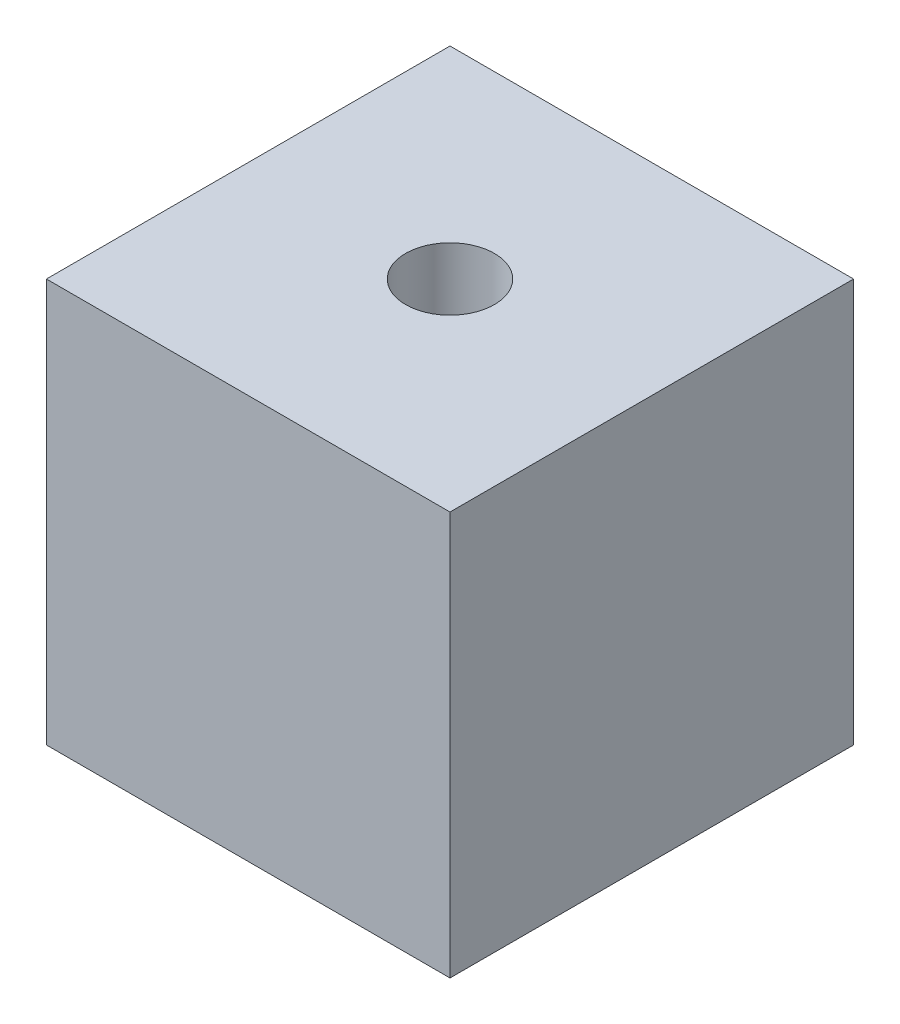
ISO-10303-21;
HEADER;
FILE_DESCRIPTION(('STEP AP214'),'2;1');
FILE_NAME('part.step','',(''),(''),'','','');
FILE_SCHEMA(('AUTOMOTIVE_DESIGN { 1 0 10303 214 1 1 1 1 }'));
ENDSEC;
DATA;
#1=APPLICATION_CONTEXT('core data for automotive mechanical design processes');
#2=APPLICATION_PROTOCOL_DEFINITION('international standard','automotive_design',2000,#1);
#3=PRODUCT_CONTEXT('',#1,'mechanical');
#4=PRODUCT('Part','Part','',(#3));
#5=PRODUCT_RELATED_PRODUCT_CATEGORY('part','',(#4));
#6=PRODUCT_DEFINITION_FORMATION('','',#4);
#7=PRODUCT_DEFINITION_CONTEXT('part definition',#1,'design');
#8=PRODUCT_DEFINITION('design','',#6,#7);
#9=PRODUCT_DEFINITION_SHAPE('','',#8);
#10=(LENGTH_UNIT() NAMED_UNIT(*) SI_UNIT(.MILLI.,.METRE.));
#11=(NAMED_UNIT(*) PLANE_ANGLE_UNIT() SI_UNIT($,.RADIAN.));
#12=(NAMED_UNIT(*) SI_UNIT($,.STERADIAN.) SOLID_ANGLE_UNIT());
#13=UNCERTAINTY_MEASURE_WITH_UNIT(LENGTH_MEASURE(1.E-05),#10,'distance_accuracy_value','');
#14=(GEOMETRIC_REPRESENTATION_CONTEXT(3) GLOBAL_UNCERTAINTY_ASSIGNED_CONTEXT((#13)) GLOBAL_UNIT_ASSIGNED_CONTEXT((#10,
#11,#12)) REPRESENTATION_CONTEXT('',''));
#15=CARTESIAN_POINT('',(0.,0.,0.));
#16=DIRECTION('',(0.,0.,1.));
#17=DIRECTION('',(1.,0.,0.));
#18=AXIS2_PLACEMENT_3D('',#15,#16,#17);
#19=CARTESIAN_POINT('',(0.,10.,0.));
#20=DIRECTION('',(1.,0.,0.));
#21=DIRECTION('',(0.,0.,-1.));
#22=AXIS2_PLACEMENT_3D('',#19,#20,#21);
#23=PLANE('',#22);
#24=DIRECTION('',(0.,0.,1.));
#25=VECTOR('',#24,1.);
#26=CARTESIAN_POINT('',(0.,0.,0.));
#27=LINE('',#26,#25);
#28=CARTESIAN_POINT('',(0.,0.,-10.));
#29=VERTEX_POINT('',#28);
#30=CARTESIAN_POINT('',(0.,0.,0.));
#31=VERTEX_POINT('',#30);
#32=EDGE_CURVE('E102',#29,#31,#27,.T.);
#33=ORIENTED_EDGE('',*,*,#32,.T.);
#34=DIRECTION('',(0.,-1.,0.));
#35=VECTOR('',#34,1.);
#36=CARTESIAN_POINT('',(0.,10.,0.));
#37=LINE('',#36,#35);
#38=CARTESIAN_POINT('',(0.,10.,0.));
#39=VERTEX_POINT('',#38);
#40=EDGE_CURVE('E11',#39,#31,#37,.T.);
#41=ORIENTED_EDGE('',*,*,#40,.F.);
#42=DIRECTION('',(0.,0.,1.));
#43=VECTOR('',#42,1.);
#44=CARTESIAN_POINT('',(0.,10.,0.));
#45=LINE('',#44,#43);
#46=CARTESIAN_POINT('',(0.,10.,-10.));
#47=VERTEX_POINT('',#46);
#48=EDGE_CURVE('E113',#47,#39,#45,.T.);
#49=ORIENTED_EDGE('',*,*,#48,.F.);
#50=DIRECTION('',(0.,-1.,0.));
#51=VECTOR('',#50,1.);
#52=CARTESIAN_POINT('',(0.,10.,-10.));
#53=LINE('',#52,#51);
#54=EDGE_CURVE('E122',#47,#29,#53,.T.);
#55=ORIENTED_EDGE('',*,*,#54,.T.);
#56=EDGE_LOOP('',(#33,#41,#49,#55));
#57=FACE_BOUND('',#56,.T.);
#58=ADVANCED_FACE('F39',(#57),#23,.F.);
#59=CARTESIAN_POINT('',(0.,10.,0.));
#60=DIRECTION('',(0.,0.,-1.));
#61=DIRECTION('',(-1.,0.,0.));
#62=AXIS2_PLACEMENT_3D('',#59,#60,#61);
#63=PLANE('',#62);
#64=DIRECTION('',(1.,0.,0.));
#65=VECTOR('',#64,1.);
#66=CARTESIAN_POINT('',(0.,0.,0.));
#67=LINE('',#66,#65);
#68=CARTESIAN_POINT('',(10.,0.,0.));
#69=VERTEX_POINT('',#68);
#70=EDGE_CURVE('E108',#31,#69,#67,.T.);
#71=ORIENTED_EDGE('',*,*,#70,.T.);
#72=DIRECTION('',(0.,-1.,0.));
#73=VECTOR('',#72,1.);
#74=CARTESIAN_POINT('',(10.,10.,0.));
#75=LINE('',#74,#73);
#76=CARTESIAN_POINT('',(10.,10.,0.));
#77=VERTEX_POINT('',#76);
#78=EDGE_CURVE('E48',#77,#69,#75,.T.);
#79=ORIENTED_EDGE('',*,*,#78,.F.);
#80=DIRECTION('',(1.,0.,0.));
#81=VECTOR('',#80,1.);
#82=CARTESIAN_POINT('',(0.,10.,0.));
#83=LINE('',#82,#81);
#84=EDGE_CURVE('E87',#39,#77,#83,.T.);
#85=ORIENTED_EDGE('',*,*,#84,.F.);
#86=ORIENTED_EDGE('',*,*,#40,.T.);
#87=EDGE_LOOP('',(#71,#79,#85,#86));
#88=FACE_BOUND('',#87,.T.);
#89=ADVANCED_FACE('F152',(#88),#63,.F.);
#90=CARTESIAN_POINT('',(10.,10.,0.));
#91=DIRECTION('',(-1.,0.,0.));
#92=DIRECTION('',(0.,0.,1.));
#93=AXIS2_PLACEMENT_3D('',#90,#91,#92);
#94=PLANE('',#93);
#95=DIRECTION('',(0.,0.,-1.));
#96=VECTOR('',#95,1.);
#97=CARTESIAN_POINT('',(10.,0.,0.));
#98=LINE('',#97,#96);
#99=CARTESIAN_POINT('',(10.,0.,-10.));
#100=VERTEX_POINT('',#99);
#101=EDGE_CURVE('E74',#69,#100,#98,.T.);
#102=ORIENTED_EDGE('',*,*,#101,.T.);
#103=DIRECTION('',(0.,-1.,0.));
#104=VECTOR('',#103,1.);
#105=CARTESIAN_POINT('',(10.,10.,-10.));
#106=LINE('',#105,#104);
#107=CARTESIAN_POINT('',(10.,10.,-10.));
#108=VERTEX_POINT('',#107);
#109=EDGE_CURVE('E132',#108,#100,#106,.T.);
#110=ORIENTED_EDGE('',*,*,#109,.F.);
#111=DIRECTION('',(0.,0.,-1.));
#112=VECTOR('',#111,1.);
#113=CARTESIAN_POINT('',(10.,10.,0.));
#114=LINE('',#113,#112);
#115=EDGE_CURVE('E118',#77,#108,#114,.T.);
#116=ORIENTED_EDGE('',*,*,#115,.F.);
#117=ORIENTED_EDGE('',*,*,#78,.T.);
#118=EDGE_LOOP('',(#102,#110,#116,#117));
#119=FACE_BOUND('',#118,.T.);
#120=ADVANCED_FACE('F136',(#119),#94,.F.);
#121=CARTESIAN_POINT('',(0.,10.,-10.));
#122=DIRECTION('',(0.,0.,1.));
#123=DIRECTION('',(1.,0.,0.));
#124=AXIS2_PLACEMENT_3D('',#121,#122,#123);
#125=PLANE('',#124);
#126=DIRECTION('',(-1.,0.,0.));
#127=VECTOR('',#126,1.);
#128=CARTESIAN_POINT('',(0.,0.,-10.));
#129=LINE('',#128,#127);
#130=EDGE_CURVE('E80',#100,#29,#129,.T.);
#131=ORIENTED_EDGE('',*,*,#130,.T.);
#132=ORIENTED_EDGE('',*,*,#54,.F.);
#133=DIRECTION('',(-1.,0.,0.));
#134=VECTOR('',#133,1.);
#135=CARTESIAN_POINT('',(0.,10.,-10.));
#136=LINE('',#135,#134);
#137=EDGE_CURVE('E56',#108,#47,#136,.T.);
#138=ORIENTED_EDGE('',*,*,#137,.F.);
#139=ORIENTED_EDGE('',*,*,#109,.T.);
#140=EDGE_LOOP('',(#131,#132,#138,#139));
#141=FACE_BOUND('',#140,.T.);
#142=ADVANCED_FACE('F142',(#141),#125,.F.);
#143=CARTESIAN_POINT('',(0.,10.,0.));
#144=DIRECTION('',(0.,-1.,0.));
#145=DIRECTION('',(0.,0.,-1.));
#146=AXIS2_PLACEMENT_3D('',#143,#144,#145);
#147=PLANE('',#146);
#148=CARTESIAN_POINT('',(5.,10.,-5.));
#149=DIRECTION('',(0.,1.,0.));
#150=DIRECTION('',(0.,0.,1.));
#151=AXIS2_PLACEMENT_3D('',#148,#149,#150);
#152=CIRCLE('',#151,1.1);
#153=CARTESIAN_POINT('',(5.,10.,-3.9));
#154=VERTEX_POINT('',#153);
#155=EDGE_CURVE('E103',#154,#154,#152,.T.);
#156=ORIENTED_EDGE('',*,*,#155,.F.);
#157=EDGE_LOOP('',(#156));
#158=FACE_BOUND('',#157,.T.);
#159=ORIENTED_EDGE('',*,*,#48,.T.);
#160=ORIENTED_EDGE('',*,*,#84,.T.);
#161=ORIENTED_EDGE('',*,*,#115,.T.);
#162=ORIENTED_EDGE('',*,*,#137,.T.);
#163=EDGE_LOOP('',(#159,#160,#161,#162));
#164=FACE_BOUND('',#163,.T.);
#165=ADVANCED_FACE('F144',(#158,#164),#147,.F.);
#166=CARTESIAN_POINT('',(0.,0.,0.));
#167=DIRECTION('',(0.,-1.,0.));
#168=DIRECTION('',(0.,0.,-1.));
#169=AXIS2_PLACEMENT_3D('',#166,#167,#168);
#170=PLANE('',#169);
#171=ORIENTED_EDGE('',*,*,#32,.F.);
#172=ORIENTED_EDGE('',*,*,#130,.F.);
#173=ORIENTED_EDGE('',*,*,#101,.F.);
#174=ORIENTED_EDGE('',*,*,#70,.F.);
#175=EDGE_LOOP('',(#171,#172,#173,#174));
#176=FACE_BOUND('',#175,.T.);
#177=ADVANCED_FACE('F95',(#176),#170,.T.);
#178=CARTESIAN_POINT('',(5.,2.66094668093032,-5.));
#179=DIRECTION('',(0.,1.,0.));
#180=DIRECTION('',(0.,0.,1.));
#181=AXIS2_PLACEMENT_3D('',#178,#179,#180);
#182=CONICAL_SURFACE('',#181,1.1,1.02974425867665);
#183=CARTESIAN_POINT('',(5.,2.,-5.));
#184=VERTEX_POINT('',#183);
#185=VERTEX_LOOP('',#184);
#186=FACE_BOUND('',#185,.T.);
#187=CARTESIAN_POINT('',(5.,2.66094668093032,-5.));
#188=DIRECTION('',(0.,1.,0.));
#189=DIRECTION('',(0.,0.,1.));
#190=AXIS2_PLACEMENT_3D('',#187,#188,#189);
#191=CIRCLE('',#190,1.1);
#192=CARTESIAN_POINT('',(5.,2.66094668093032,-3.9));
#193=VERTEX_POINT('',#192);
#194=EDGE_CURVE('E99',#193,#193,#191,.T.);
#195=ORIENTED_EDGE('',*,*,#194,.T.);
#196=EDGE_LOOP('',(#195));
#197=FACE_BOUND('',#196,.T.);
#198=ADVANCED_FACE('F91',(#186,#197),#182,.F.);
#199=CARTESIAN_POINT('',(5.,10.,-5.));
#200=DIRECTION('',(0.,1.,0.));
#201=DIRECTION('',(0.,0.,1.));
#202=AXIS2_PLACEMENT_3D('',#199,#200,#201);
#203=CYLINDRICAL_SURFACE('',#202,1.1);
#204=ORIENTED_EDGE('',*,*,#194,.F.);
#205=EDGE_LOOP('',(#204));
#206=FACE_BOUND('',#205,.T.);
#207=ORIENTED_EDGE('',*,*,#155,.T.);
#208=EDGE_LOOP('',(#207));
#209=FACE_BOUND('',#208,.T.);
#210=ADVANCED_FACE('F94',(#206,#209),#203,.F.);
#211=CLOSED_SHELL('',(#58,#89,#120,#142,#165,#177,#198,#210));
#212=MANIFOLD_SOLID_BREP('B2',#211);
#213=ADVANCED_BREP_SHAPE_REPRESENTATION('',(#18,#212),#14);
#214=SHAPE_DEFINITION_REPRESENTATION(#9,#213);
ENDSEC;
END-ISO-10303-21;
